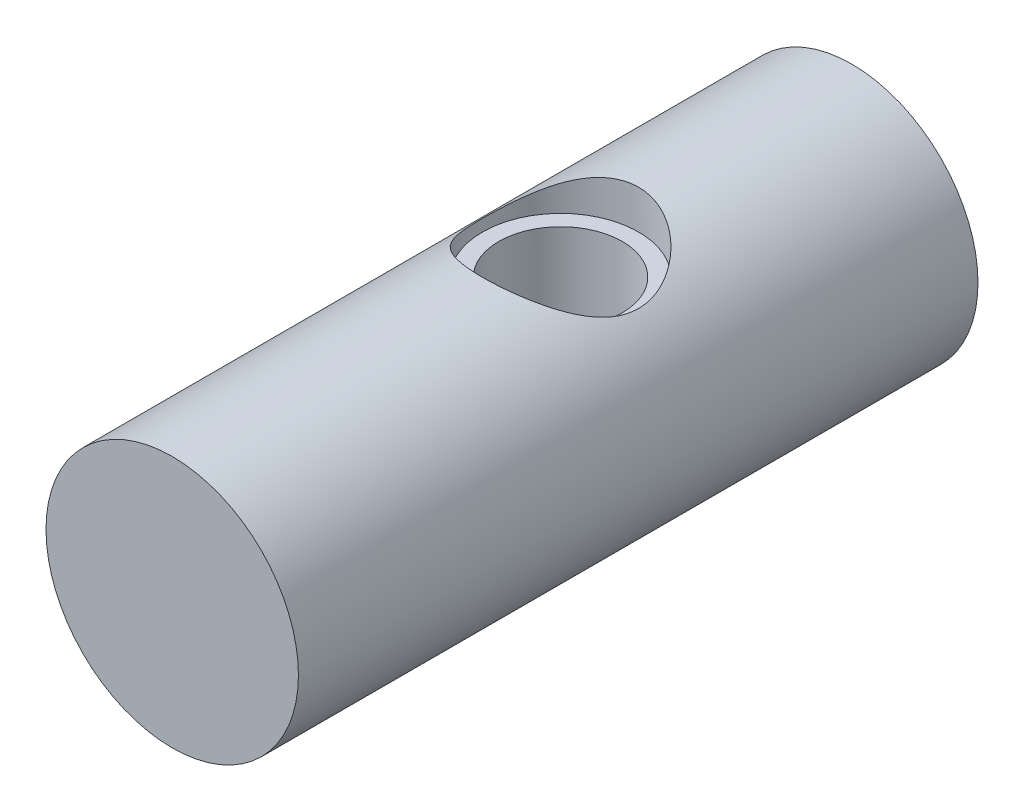
ISO-10303-21;
HEADER;
FILE_DESCRIPTION(('STEP AP214'),'2;1');
FILE_NAME('part.step','',(''),(''),'','','');
FILE_SCHEMA(('AUTOMOTIVE_DESIGN { 1 0 10303 214 1 1 1 1 }'));
ENDSEC;
DATA;
#1=APPLICATION_CONTEXT('core data for automotive mechanical design processes');
#2=APPLICATION_PROTOCOL_DEFINITION('international standard','automotive_design',2000,#1);
#3=PRODUCT_CONTEXT('',#1,'mechanical');
#4=PRODUCT('Part','Part','',(#3));
#5=PRODUCT_RELATED_PRODUCT_CATEGORY('part','',(#4));
#6=PRODUCT_DEFINITION_FORMATION('','',#4);
#7=PRODUCT_DEFINITION_CONTEXT('part definition',#1,'design');
#8=PRODUCT_DEFINITION('design','',#6,#7);
#9=PRODUCT_DEFINITION_SHAPE('','',#8);
#10=(LENGTH_UNIT() NAMED_UNIT(*) SI_UNIT(.MILLI.,.METRE.));
#11=(NAMED_UNIT(*) PLANE_ANGLE_UNIT() SI_UNIT($,.RADIAN.));
#12=(NAMED_UNIT(*) SI_UNIT($,.STERADIAN.) SOLID_ANGLE_UNIT());
#13=UNCERTAINTY_MEASURE_WITH_UNIT(LENGTH_MEASURE(1.E-05),#10,'distance_accuracy_value','');
#14=(GEOMETRIC_REPRESENTATION_CONTEXT(3) GLOBAL_UNCERTAINTY_ASSIGNED_CONTEXT((#13)) GLOBAL_UNIT_ASSIGNED_CONTEXT((#10,
#11,#12)) REPRESENTATION_CONTEXT('',''));
#15=CARTESIAN_POINT('',(0.,0.,0.));
#16=DIRECTION('',(0.,0.,1.));
#17=DIRECTION('',(1.,0.,0.));
#18=AXIS2_PLACEMENT_3D('',#15,#16,#17);
#19=CARTESIAN_POINT('',(0.,0.,22.225));
#20=DIRECTION('',(0.,0.,-1.));
#21=DIRECTION('',(-1.,0.,0.));
#22=AXIS2_PLACEMENT_3D('',#19,#20,#21);
#23=CYLINDRICAL_SURFACE('',#22,4.1275);
#24=CARTESIAN_POINT('',(0.,-4.1275,11.5443));
#25=CARTESIAN_POINT('',(0.106430851599151,-4.12749444736197,11.5442935377999));
#26=CARTESIAN_POINT('',(0.212996691670635,-4.12333883522164,11.5358360435638));
#27=CARTESIAN_POINT('',(0.422995949415078,-4.10712521904179,11.5023720088852));
#28=CARTESIAN_POINT('',(0.526422649212288,-4.09505136753962,11.4773322799852));
#29=CARTESIAN_POINT('',(0.726782067704942,-4.06426864536705,11.4119082787944));
#30=CARTESIAN_POINT('',(0.823738002560156,-4.04558520043685,11.3715827658407));
#31=CARTESIAN_POINT('',(1.00937280659074,-4.00331098221845,11.2770273434922));
#32=CARTESIAN_POINT('',(1.098052561273,-3.97972073480585,11.2227989239655));
#33=CARTESIAN_POINT('',(1.27046969283024,-3.92819641729974,11.09835210686));
#34=CARTESIAN_POINT('',(1.3536122338457,-3.90008873620463,11.0273824816622));
#35=CARTESIAN_POINT('',(1.50735858553123,-3.84328720650924,10.8730799276282));
#36=CARTESIAN_POINT('',(1.57795327692355,-3.81459294835808,10.7897380872314));
#37=CARTESIAN_POINT('',(1.70978803448255,-3.75744827985016,10.6057065276882));
#38=CARTESIAN_POINT('',(1.76996073946325,-3.72917045003671,10.5041923800936));
#39=CARTESIAN_POINT('',(1.872124449145,-3.67894944973187,10.2909452854034));
#40=CARTESIAN_POINT('',(1.9141280187131,-3.6570019050424,10.1792194651657));
#41=CARTESIAN_POINT('',(1.976099144939,-3.62387442112005,9.95543390718346));
#42=CARTESIAN_POINT('',(1.99721533582171,-3.61213811897202,9.8437786262112));
#43=CARTESIAN_POINT('',(2.02034297592589,-3.59925912247369,9.61794363468226));
#44=CARTESIAN_POINT('',(2.02237189845092,-3.59810673917338,9.50376632891108));
#45=CARTESIAN_POINT('',(2.00811240310015,-3.60607460402311,9.29001903159812));
#46=CARTESIAN_POINT('',(1.99387274721883,-3.61404606305847,9.19025936751877));
#47=CARTESIAN_POINT('',(1.95101424529304,-3.63736012050308,8.9947801832911));
#48=CARTESIAN_POINT('',(1.92239113404699,-3.65270490530422,8.89906187067803));
#49=CARTESIAN_POINT('',(1.8510399629647,-3.68938219810853,8.71166281100853));
#50=CARTESIAN_POINT('',(1.80799853919621,-3.71084599597823,8.62012827535466));
#51=CARTESIAN_POINT('',(1.70926900751339,-3.75734347684083,8.4451503402386));
#52=CARTESIAN_POINT('',(1.65357524654866,-3.78237875370074,8.36171058136726));
#53=CARTESIAN_POINT('',(1.5232755652944,-3.83685390912371,8.19468689235214));
#54=CARTESIAN_POINT('',(1.44719827577526,-3.86646068326081,8.11230131882714));
#55=CARTESIAN_POINT('',(1.28215791694875,-3.92427996052256,7.96097149567162));
#56=CARTESIAN_POINT('',(1.1931892133926,-3.95249184673682,7.89203315428231));
#57=CARTESIAN_POINT('',(1.00005877465492,-4.0058185571107,7.76680548068048));
#58=CARTESIAN_POINT('',(0.895410480669889,-4.03074967499637,7.71118203409699));
#59=CARTESIAN_POINT('',(0.676711403318789,-4.07316652895482,7.61877458142199));
#60=CARTESIAN_POINT('',(0.562667861056466,-4.09065793605066,7.58197622129221));
#61=CARTESIAN_POINT('',(0.338252924023167,-4.1150385574866,7.53118189435189));
#62=CARTESIAN_POINT('',(0.228323702617047,-4.12266723680854,7.51559023428986));
#63=CARTESIAN_POINT('',(0.00716007428527439,-4.1289733521117,7.50268093511584));
#64=CARTESIAN_POINT('',(-0.104073730958917,-4.1276547641806,7.50535517879874));
#65=CARTESIAN_POINT('',(-0.316007835403579,-4.11665346839294,7.5279440276377));
#66=CARTESIAN_POINT('',(-0.416881496070615,-4.10759255606687,7.54657720602479));
#67=CARTESIAN_POINT('',(-0.613879912066724,-4.08280156884249,7.59857697365897));
#68=CARTESIAN_POINT('',(-0.710004132240153,-4.06707074429907,7.6319452190279));
#69=CARTESIAN_POINT('',(-0.89803514852633,-4.02979549228933,7.7133943676481));
#70=CARTESIAN_POINT('',(-0.989734628286723,-4.00809362406565,7.76187928844793));
#71=CARTESIAN_POINT('',(-1.16400809561013,-3.96099774764815,7.87173632908168));
#72=CARTESIAN_POINT('',(-1.24657810912286,-3.93560214262397,7.93311402768469));
#73=CARTESIAN_POINT('',(-1.40855127324237,-3.88075076142469,8.07375070714027));
#74=CARTESIAN_POINT('',(-1.48690980867631,-3.8511384063869,8.15415400348178));
#75=CARTESIAN_POINT('',(-1.62947037868245,-3.79302273575124,8.32709834481758));
#76=CARTESIAN_POINT('',(-1.69366364684833,-3.76452011586576,8.41964684989609));
#77=CARTESIAN_POINT('',(-1.80863065652369,-3.71070345876837,8.61932177729093));
#78=CARTESIAN_POINT('',(-1.85871007804858,-3.68557881125453,8.7269034334361));
#79=CARTESIAN_POINT('',(-1.9395185812725,-3.64371064732012,8.95059916966811));
#80=CARTESIAN_POINT('',(-1.97027151298642,-3.62695680609342,9.06670253497906));
#81=CARTESIAN_POINT('',(-2.00880712335526,-3.60574409151373,9.29239119251585));
#82=CARTESIAN_POINT('',(-2.01848518512615,-3.6002733185027,9.40155621667872));
#83=CARTESIAN_POINT('',(-2.02001488108109,-3.59941710611114,9.62003278838475));
#84=CARTESIAN_POINT('',(-2.01187321496558,-3.60402787636235,9.7293442654232));
#85=CARTESIAN_POINT('',(-1.97974684126578,-3.62175940030485,9.93494091048763));
#86=CARTESIAN_POINT('',(-1.95721256977093,-3.63409923897986,10.0315283146689));
#87=CARTESIAN_POINT('',(-1.89867926063187,-3.6650187343866,10.2194663380484));
#88=CARTESIAN_POINT('',(-1.86267602221741,-3.68360033764701,10.3108153131968));
#89=CARTESIAN_POINT('',(-1.77550269424463,-3.72643942812494,10.4924642148567));
#90=CARTESIAN_POINT('',(-1.72347567387513,-3.75099451652664,10.5822807365014));
#91=CARTESIAN_POINT('',(-1.60670906648937,-3.80247452710881,10.7524861148838));
#92=CARTESIAN_POINT('',(-1.54196304334027,-3.82940064526758,10.8328701655237));
#93=CARTESIAN_POINT('',(-1.39289399910264,-3.88627894993259,10.9914841532562));
#94=CARTESIAN_POINT('',(-1.30717852754724,-3.9162247974751,11.0684147968835));
#95=CARTESIAN_POINT('',(-1.12316909200892,-3.97290921444102,11.2070619745108));
#96=CARTESIAN_POINT('',(-1.0248687054172,-3.99964613262016,11.2687706927323));
#97=CARTESIAN_POINT('',(-0.817674628631473,-4.04709601084552,11.3750189661405));
#98=CARTESIAN_POINT('',(-0.708754333922451,-4.06779329501862,11.4195139387478));
#99=CARTESIAN_POINT('',(-0.483814585705648,-4.10060953811888,11.4889922126767));
#100=CARTESIAN_POINT('',(-0.367816697572937,-4.11275326772519,11.5140318775207));
#101=CARTESIAN_POINT('',(-0.208922168266524,-4.12242133540004,11.5339013646459));
#102=CARTESIAN_POINT('',(-0.167263081008713,-4.12432128118865,11.5377957984437));
#103=CARTESIAN_POINT('',(-0.0837429671550342,-4.126861722707,11.5429964219213));
#104=CARTESIAN_POINT('',(-0.0418819352332057,-4.12750218503585,11.5443025429605));
#105=CARTESIAN_POINT('',(0.,-4.1275,11.5443));
#106=B_SPLINE_CURVE_WITH_KNOTS('',3,(#24,#25,#26,#27,#28,#29,#30,#31,#32,#33,#34,#35,#36,#37,
#38,#39,#40,#41,#42,#43,#44,#45,#46,#47,#48,#49,#50,#51,#52,#53,#54,#55,#56,#57,#58,#59,#60,#61,
#62,#63,#64,#65,#66,#67,#68,#69,#70,#71,#72,#73,#74,#75,#76,#77,#78,#79,#80,#81,#82,#83,#84,#85,
#86,#87,#88,#89,#90,#91,#92,#93,#94,#95,#96,#97,#98,#99,#100,#101,#102,#103,#104,#105),
.UNSPECIFIED.,.T.,.F.,(4,2,2,2,2,2,2,2,2,2,2,2,2,2,2,2,2,2,2,2,2,2,2,2,2,2,2,2,2,2,2,2,2,2,2,2,
2,2,2,2,4),(0.,0.319122239526545,0.638885123353688,0.957431086624994,1.2759429280182,
1.61313388609558,1.95056890798209,2.31277848056271,2.67473716505921,3.01545201616525,
3.35585493190821,3.65770063599823,3.95963590084669,4.26861235329444,4.57772712854287,
4.92415463530394,5.2707340089811,5.63211378679941,5.99321760201835,6.32528329572115,
6.65720143198781,6.96472710013983,7.27228734089714,7.58889727248987,7.90564448603005,
8.25245863460198,8.5994868165348,8.96141131398275,9.32288829390285,9.65021990684105,
9.97742847373523,10.2759715150636,10.5746077452527,10.8933211003536,11.2121961497435,
11.5675636616037,11.9231132607669,12.2795776441354,12.6350054318093,12.7605808860632,
12.8861596704712),.UNSPECIFIED.);
#107=CARTESIAN_POINT('',(0.,-4.1275,11.5443));
#108=VERTEX_POINT('',#107);
#109=EDGE_CURVE('E10',#108,#108,#106,.T.);
#110=ORIENTED_EDGE('',*,*,#109,.T.);
#111=EDGE_LOOP('',(#110));
#112=FACE_BOUND('',#111,.T.);
#113=CARTESIAN_POINT('',(0.,4.1275,12.0777));
#114=CARTESIAN_POINT('',(-0.129927204993866,4.12749061221144,12.0776897172107));
#115=CARTESIAN_POINT('',(-0.260028734694938,4.12129960911788,12.0677117544413));
#116=CARTESIAN_POINT('',(-0.516259225713817,4.0971188711901,12.028324950462));
#117=CARTESIAN_POINT('',(-0.642379455480204,4.07910486778609,11.9988761413527));
#118=CARTESIAN_POINT('',(-0.886426826681688,4.03309438346793,11.9222490774528));
#119=CARTESIAN_POINT('',(-1.00439118536643,4.00514739419905,11.8751586611645));
#120=CARTESIAN_POINT('',(-1.23034539280252,3.94161153133372,11.7651639397574));
#121=CARTESIAN_POINT('',(-1.3383366917595,3.9060237713096,11.7022619388041));
#122=CARTESIAN_POINT('',(-1.55092990894677,3.82684356737582,11.5569356446243));
#123=CARTESIAN_POINT('',(-1.65459012297972,3.78284086021057,11.4733616760245));
#124=CARTESIAN_POINT('',(-1.84733814321221,3.69255367751548,11.2916898231097));
#125=CARTESIAN_POINT('',(-1.93640626412964,3.64626622748943,11.1935726536573));
#126=CARTESIAN_POINT('',(-2.10940024069629,3.54933106526484,10.9704068306853));
#127=CARTESIAN_POINT('',(-2.19109438412078,3.49891458810548,10.843512778694));
#128=CARTESIAN_POINT('',(-2.33173808849345,3.40680849658378,10.5748402065043));
#129=CARTESIAN_POINT('',(-2.3907257253847,3.36510432697278,10.4330871155144));
#130=CARTESIAN_POINT('',(-2.47113454871353,3.30629297916759,10.1754295017275));
#131=CARTESIAN_POINT('',(-2.49829672472902,3.2856266221591,10.0621338771491));
#132=CARTESIAN_POINT('',(-2.53692355433158,3.25590085097482,9.83146911342623));
#133=CARTESIAN_POINT('',(-2.54840965849094,3.24682557707226,9.71410576650405));
#134=CARTESIAN_POINT('',(-2.55500290083269,3.24164152055996,9.47833539422303));
#135=CARTESIAN_POINT('',(-2.5500701438679,3.24556432104035,9.35992652498342));
#136=CARTESIAN_POINT('',(-2.52406746369942,3.26582205295605,9.1259487268579));
#137=CARTESIAN_POINT('',(-2.50298479838982,3.28216678508309,9.01038211482762));
#138=CARTESIAN_POINT('',(-2.44644659667177,3.32450827039894,8.78732293504354));
#139=CARTESIAN_POINT('',(-2.41128781352017,3.35030486091982,8.67971491774004));
#140=CARTESIAN_POINT('',(-2.32795568534506,3.40873324210875,8.47168553782489));
#141=CARTESIAN_POINT('',(-2.27977769842353,3.44136746975017,8.37126675466436));
#142=CARTESIAN_POINT('',(-2.16159330005004,3.51703638626112,8.16084788179404));
#143=CARTESIAN_POINT('',(-2.0892024942131,3.56088025482415,8.05247847539596));
#144=CARTESIAN_POINT('',(-1.92915594107218,3.65007117531444,7.8482510260087));
#145=CARTESIAN_POINT('',(-1.84148475658398,3.69541970947321,7.7524058087284));
#146=CARTESIAN_POINT('',(-1.63701280584026,3.79092469893884,7.56053833332441));
#147=CARTESIAN_POINT('',(-1.51779822324048,3.84070895257662,7.46688006304595));
#148=CARTESIAN_POINT('',(-1.26227436606015,3.93207828789507,7.30102866811973));
#149=CARTESIAN_POINT('',(-1.12597258148968,3.97366694161928,7.22882618498889));
#150=CARTESIAN_POINT('',(-0.915497457659415,4.02529391451413,7.1409874958509));
#151=CARTESIAN_POINT('',(-0.846496449855861,4.04039997502937,7.11560775739631));
#152=CARTESIAN_POINT('',(-0.70598876641237,4.06730097341886,7.07076203207316));
#153=CARTESIAN_POINT('',(-0.634483552825941,4.07909780825873,7.05129265664644));
#154=CARTESIAN_POINT('',(-0.48961668163942,4.0990085554321,7.01859611591642));
#155=CARTESIAN_POINT('',(-0.416256661038519,4.10712560335241,7.00536363570319));
#156=CARTESIAN_POINT('',(-0.268364510805392,4.11943618436374,6.98534757947914));
#157=CARTESIAN_POINT('',(-0.193832573578759,4.12363035481392,6.97856295586695));
#158=CARTESIAN_POINT('',(0.00866368058105994,4.12945862678342,6.96912523326944));
#159=CARTESIAN_POINT('',(0.13711528075803,4.12718064136577,6.97279356901892));
#160=CARTESIAN_POINT('',(0.391184739439764,4.11089705219719,6.999213890067));
#161=CARTESIAN_POINT('',(0.516802750254599,4.096892080341,7.02196484712134));
#162=CARTESIAN_POINT('',(0.757436006833957,4.05917061058872,7.08420628592588));
#163=CARTESIAN_POINT('',(0.872668484638151,4.03581127463958,7.12308283873908));
#164=CARTESIAN_POINT('',(1.09487541193565,3.98128271400859,7.21587903986054));
#165=CARTESIAN_POINT('',(1.20184841725702,3.95011212755359,7.26980131134795));
#166=CARTESIAN_POINT('',(1.41633169028601,3.87869861181047,7.3972328708793));
#167=CARTESIAN_POINT('',(1.52278543102317,3.83785480904499,7.47217837343442));
#168=CARTESIAN_POINT('',(1.7223709887011,3.75253285361653,7.63649329381402));
#169=CARTESIAN_POINT('',(1.81548751299029,3.70805061940953,7.72587902315386));
#170=CARTESIAN_POINT('',(1.99939182513879,3.61259848977712,7.93116660642224));
#171=CARTESIAN_POINT('',(2.08798634710009,3.56160108589076,8.04903076075194));
#172=CARTESIAN_POINT('',(2.24437555982974,3.46518091535854,8.29990472187189));
#173=CARTESIAN_POINT('',(2.31218681232742,3.41975372734091,8.43290235261795));
#174=CARTESIAN_POINT('',(2.41247490056179,3.34950013408949,8.68223248202533));
#175=CARTESIAN_POINT('',(2.44939621638203,3.32234778058661,8.79611272079967));
#176=CARTESIAN_POINT('',(2.5070969188295,3.27903091883032,9.02984271957724));
#177=CARTESIAN_POINT('',(2.52790089203778,3.2628496791585,9.14968308914611));
#178=CARTESIAN_POINT('',(2.55221483680573,3.2438737215009,9.39283925482633));
#179=CARTESIAN_POINT('',(2.55563545682171,3.24114816864417,9.51616973705482));
#180=CARTESIAN_POINT('',(2.54468272632573,3.24975157046312,9.76156606937576));
#181=CARTESIAN_POINT('',(2.53030219126949,3.26108619983073,9.88363138879361));
#182=CARTESIAN_POINT('',(2.48637070923539,3.29467668891649,10.114088710911));
#183=CARTESIAN_POINT('',(2.45797923153744,3.31609281207265,10.2228340483163));
#184=CARTESIAN_POINT('',(2.38797017868018,3.36685558900392,10.4339899882482));
#185=CARTESIAN_POINT('',(2.34634730797517,3.39620541734802,10.5363980347884));
#186=CARTESIAN_POINT('',(2.24402860188561,3.46481073490585,10.74828821962));
#187=CARTESIAN_POINT('',(2.18142246494405,3.50488924050649,10.8565768925284));
#188=CARTESIAN_POINT('',(2.04177091048187,3.58804123478645,11.0621766516908));
#189=CARTESIAN_POINT('',(1.96471363628573,3.631117164368,11.1594786179415));
#190=CARTESIAN_POINT('',(1.78136185522739,3.72498638944889,11.3593221609761));
#191=CARTESIAN_POINT('',(1.67229406534117,3.77569880709863,11.459375558733));
#192=CARTESIAN_POINT('',(1.43670849831639,3.87146589662631,11.6402185148541));
#193=CARTESIAN_POINT('',(1.31018128364081,3.91651748325731,11.7209975897655));
#194=CARTESIAN_POINT('',(1.10988465297456,3.97608525604642,11.8250132993703));
#195=CARTESIAN_POINT('',(1.04159495923878,3.99456142449676,11.8567545571877));
#196=CARTESIAN_POINT('',(0.901830459198083,4.02841325193296,11.9142841859355));
#197=CARTESIAN_POINT('',(0.830357527324288,4.04379070685968,11.9400760062805));
#198=CARTESIAN_POINT('',(0.684975715782407,4.07093604080577,11.9852572496202));
#199=CARTESIAN_POINT('',(0.611074194460101,4.08271387792601,12.0046643471186));
#200=CARTESIAN_POINT('',(0.461367255000558,4.10232701065932,12.0368262625457));
#201=CARTESIAN_POINT('',(0.38556333645939,4.11016531516321,12.0495861576707));
#202=CARTESIAN_POINT('',(0.258007324892567,4.11974824950272,12.0651515666145));
#203=CARTESIAN_POINT('',(0.206565069269836,4.12264991237455,12.0698519936642));
#204=CARTESIAN_POINT('',(0.103424429124771,4.12652771402856,12.0761283508433));
#205=CARTESIAN_POINT('',(0.0517260294400093,4.12750373742379,12.0777040937374));
#206=CARTESIAN_POINT('',(0.,4.1275,12.0777));
#207=B_SPLINE_CURVE_WITH_KNOTS('',3,(#113,#114,#115,#116,#117,#118,#119,#120,#121,#122,#123,
#124,#125,#126,#127,#128,#129,#130,#131,#132,#133,#134,#135,#136,#137,#138,#139,#140,#141,#142,
#143,#144,#145,#146,#147,#148,#149,#150,#151,#152,#153,#154,#155,#156,#157,#158,#159,#160,#161,
#162,#163,#164,#165,#166,#167,#168,#169,#170,#171,#172,#173,#174,#175,#176,#177,#178,#179,#180,
#181,#182,#183,#184,#185,#186,#187,#188,#189,#190,#191,#192,#193,#194,#195,#196,#197,#198,#199,
#200,#201,#202,#203,#204,#205,#206),.UNSPECIFIED.,.T.,.F.,(4,2,2,2,2,2,2,2,2,2,2,2,2,2,2,2,2,2,
2,2,2,2,2,2,2,2,2,2,2,2,2,2,2,2,2,2,2,2,2,2,2,2,2,2,2,2,4),(0.,0.389573323048361,
0.779948818195827,1.16840590212658,1.55680641037995,1.97588997810082,2.39553433109278,
2.87058653153854,3.34483862274399,3.69833237679813,4.05134193610803,4.40520987646667,
4.75935730279939,5.10640170175681,5.45357000038383,5.86453939689997,6.27592641252355,
6.75230274268521,7.22847098326837,7.4533540365914,7.678107914302,7.9026699151203,
8.12719542447939,8.51061025876065,8.89400443451842,9.26397614064943,9.63401239066536,
10.0417641744762,10.4499798126786,10.9159486739733,11.3815452436732,11.7483437208863,
12.1145815488696,12.4826999721485,12.8509670164371,13.1928758633593,13.5349217236964,
13.9275503908322,14.3205026173036,14.7877569655432,15.2552648806381,15.4875888988694,
15.7197778778648,15.9513185828423,16.1826821745646,16.3377680459713,16.4928632100518),.UNSPECIFIED.);
#208=CARTESIAN_POINT('',(0.,4.1275,12.0777));
#209=VERTEX_POINT('',#208);
#210=EDGE_CURVE('E51',#209,#209,#207,.T.);
#211=ORIENTED_EDGE('',*,*,#210,.T.);
#212=EDGE_LOOP('',(#211));
#213=FACE_BOUND('',#212,.T.);
#214=CARTESIAN_POINT('',(0.,0.,22.225));
#215=DIRECTION('',(0.,0.,1.));
#216=DIRECTION('',(1.,0.,0.));
#217=AXIS2_PLACEMENT_3D('',#214,#215,#216);
#218=CIRCLE('',#217,4.1275);
#219=CARTESIAN_POINT('',(4.1275,0.,22.225));
#220=VERTEX_POINT('',#219);
#221=EDGE_CURVE('E56',#220,#220,#218,.T.);
#222=ORIENTED_EDGE('',*,*,#221,.F.);
#223=EDGE_LOOP('',(#222));
#224=FACE_BOUND('',#223,.T.);
#225=CARTESIAN_POINT('',(0.,0.,0.));
#226=DIRECTION('',(0.,0.,1.));
#227=DIRECTION('',(1.,0.,0.));
#228=AXIS2_PLACEMENT_3D('',#225,#226,#227);
#229=CIRCLE('',#228,4.1275);
#230=CARTESIAN_POINT('',(4.1275,0.,0.));
#231=VERTEX_POINT('',#230);
#232=EDGE_CURVE('E61',#231,#231,#229,.T.);
#233=ORIENTED_EDGE('',*,*,#232,.T.);
#234=EDGE_LOOP('',(#233));
#235=FACE_BOUND('',#234,.T.);
#236=ADVANCED_FACE('F39',(#112,#213,#224,#235),#23,.T.);
#237=CARTESIAN_POINT('',(0.,0.,22.225));
#238=DIRECTION('',(0.,0.,1.));
#239=DIRECTION('',(1.,0.,0.));
#240=AXIS2_PLACEMENT_3D('',#237,#238,#239);
#241=PLANE('',#240);
#242=ORIENTED_EDGE('',*,*,#221,.T.);
#243=EDGE_LOOP('',(#242));
#244=FACE_BOUND('',#243,.T.);
#245=ADVANCED_FACE('F80',(#244),#241,.T.);
#246=CARTESIAN_POINT('',(0.,0.,0.));
#247=DIRECTION('',(0.,0.,1.));
#248=DIRECTION('',(1.,0.,0.));
#249=AXIS2_PLACEMENT_3D('',#246,#247,#248);
#250=PLANE('',#249);
#251=ORIENTED_EDGE('',*,*,#232,.F.);
#252=EDGE_LOOP('',(#251));
#253=FACE_BOUND('',#252,.T.);
#254=ADVANCED_FACE('F73',(#253),#250,.F.);
#255=CARTESIAN_POINT('',(0.,4.1275,9.525));
#256=DIRECTION('',(0.,1.,0.));
#257=DIRECTION('',(0.,0.,1.));
#258=AXIS2_PLACEMENT_3D('',#255,#256,#257);
#259=CYLINDRICAL_SURFACE('',#258,2.5527);
#260=CARTESIAN_POINT('',(0.,2.8575,9.525));
#261=DIRECTION('',(0.,1.,0.));
#262=DIRECTION('',(0.,0.,1.));
#263=AXIS2_PLACEMENT_3D('',#260,#261,#262);
#264=CIRCLE('',#263,2.5527);
#265=CARTESIAN_POINT('',(0.,2.8575,12.0777));
#266=VERTEX_POINT('',#265);
#267=EDGE_CURVE('E96',#266,#266,#264,.T.);
#268=ORIENTED_EDGE('',*,*,#267,.F.);
#269=EDGE_LOOP('',(#268));
#270=FACE_BOUND('',#269,.T.);
#271=ORIENTED_EDGE('',*,*,#210,.F.);
#272=EDGE_LOOP('',(#271));
#273=FACE_BOUND('',#272,.T.);
#274=ADVANCED_FACE('F68',(#270,#273),#259,.F.);
#275=CARTESIAN_POINT('',(0.,2.8575,9.525));
#276=DIRECTION('',(0.,-1.,0.));
#277=DIRECTION('',(0.,0.,-1.));
#278=AXIS2_PLACEMENT_3D('',#275,#276,#277);
#279=PLANE('',#278);
#280=CARTESIAN_POINT('',(0.,2.8575,9.525));
#281=DIRECTION('',(0.,-1.,0.));
#282=DIRECTION('',(0.,0.,-1.));
#283=AXIS2_PLACEMENT_3D('',#280,#281,#282);
#284=CIRCLE('',#283,2.0193);
#285=CARTESIAN_POINT('',(0.,2.8575,7.5057));
#286=VERTEX_POINT('',#285);
#287=EDGE_CURVE('E99',#286,#286,#284,.T.);
#288=ORIENTED_EDGE('',*,*,#287,.T.);
#289=EDGE_LOOP('',(#288));
#290=FACE_BOUND('',#289,.T.);
#291=ORIENTED_EDGE('',*,*,#267,.T.);
#292=EDGE_LOOP('',(#291));
#293=FACE_BOUND('',#292,.T.);
#294=ADVANCED_FACE('F72',(#290,#293),#279,.F.);
#295=CARTESIAN_POINT('',(0.,4.1275,9.525));
#296=DIRECTION('',(0.,1.,0.));
#297=DIRECTION('',(0.,0.,1.));
#298=AXIS2_PLACEMENT_3D('',#295,#296,#297);
#299=CYLINDRICAL_SURFACE('',#298,2.0193);
#300=ORIENTED_EDGE('',*,*,#109,.F.);
#301=EDGE_LOOP('',(#300));
#302=FACE_BOUND('',#301,.T.);
#303=ORIENTED_EDGE('',*,*,#287,.F.);
#304=EDGE_LOOP('',(#303));
#305=FACE_BOUND('',#304,.T.);
#306=ADVANCED_FACE('F75',(#302,#305),#299,.F.);
#307=CLOSED_SHELL('',(#236,#245,#254,#274,#294,#306));
#308=MANIFOLD_SOLID_BREP('B2',#307);
#309=ADVANCED_BREP_SHAPE_REPRESENTATION('',(#18,#308),#14);
#310=SHAPE_DEFINITION_REPRESENTATION(#9,#309);
ENDSEC;
END-ISO-10303-21;
